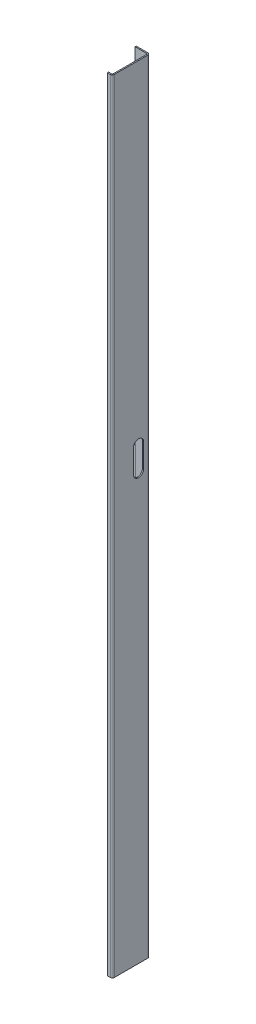
ISO-10303-21;
HEADER;
FILE_DESCRIPTION(('STEP AP214'),'2;1');
FILE_NAME('part.step','',(''),(''),'','','');
FILE_SCHEMA(('AUTOMOTIVE_DESIGN { 1 0 10303 214 1 1 1 1 }'));
ENDSEC;
DATA;
#1=APPLICATION_CONTEXT('core data for automotive mechanical design processes');
#2=APPLICATION_PROTOCOL_DEFINITION('international standard','automotive_design',2000,#1);
#3=PRODUCT_CONTEXT('',#1,'mechanical');
#4=PRODUCT('Part','Part','',(#3));
#5=PRODUCT_RELATED_PRODUCT_CATEGORY('part','',(#4));
#6=PRODUCT_DEFINITION_FORMATION('','',#4);
#7=PRODUCT_DEFINITION_CONTEXT('part definition',#1,'design');
#8=PRODUCT_DEFINITION('design','',#6,#7);
#9=PRODUCT_DEFINITION_SHAPE('','',#8);
#10=(LENGTH_UNIT() NAMED_UNIT(*) SI_UNIT(.MILLI.,.METRE.));
#11=(NAMED_UNIT(*) PLANE_ANGLE_UNIT() SI_UNIT($,.RADIAN.));
#12=(NAMED_UNIT(*) SI_UNIT($,.STERADIAN.) SOLID_ANGLE_UNIT());
#13=UNCERTAINTY_MEASURE_WITH_UNIT(LENGTH_MEASURE(1.E-05),#10,'distance_accuracy_value','');
#14=(GEOMETRIC_REPRESENTATION_CONTEXT(3) GLOBAL_UNCERTAINTY_ASSIGNED_CONTEXT((#13)) GLOBAL_UNIT_ASSIGNED_CONTEXT((#10,
#11,#12)) REPRESENTATION_CONTEXT('',''));
#15=CARTESIAN_POINT('',(0.,0.,0.));
#16=DIRECTION('',(0.,0.,1.));
#17=DIRECTION('',(1.,0.,0.));
#18=AXIS2_PLACEMENT_3D('',#15,#16,#17);
#19=CARTESIAN_POINT('',(-1.5,0.,0.));
#20=DIRECTION('',(-1.,0.,0.));
#21=DIRECTION('',(0.,0.,1.));
#22=AXIS2_PLACEMENT_3D('',#19,#20,#21);
#23=PLANE('',#22);
#24=CARTESIAN_POINT('',(-1.5,544.500000000003,-33.5459415460403));
#25=DIRECTION('',(1.,0.,0.));
#26=DIRECTION('',(0.,0.,-1.));
#27=AXIS2_PLACEMENT_3D('',#24,#25,#26);
#28=CIRCLE('',#27,6.5);
#29=CARTESIAN_POINT('',(-1.5,544.500000000003,-27.0459415460403));
#30=VERTEX_POINT('',#29);
#31=CARTESIAN_POINT('',(-1.5,544.500000000003,-40.0459415460404));
#32=VERTEX_POINT('',#31);
#33=EDGE_CURVE('E198',#30,#32,#28,.T.);
#34=ORIENTED_EDGE('',*,*,#33,.T.);
#35=DIRECTION('',(0.,1.,0.));
#36=VECTOR('',#35,1.);
#37=CARTESIAN_POINT('',(-1.5,544.500000000003,-40.0459415460404));
#38=LINE('',#37,#36);
#39=CARTESIAN_POINT('',(-1.5,574.500000000003,-40.0459415460404));
#40=VERTEX_POINT('',#39);
#41=EDGE_CURVE('E207',#32,#40,#38,.T.);
#42=ORIENTED_EDGE('',*,*,#41,.T.);
#43=CARTESIAN_POINT('',(-1.5,574.500000000003,-33.5459415460403));
#44=DIRECTION('',(1.,0.,0.));
#45=DIRECTION('',(0.,0.,-1.));
#46=AXIS2_PLACEMENT_3D('',#43,#44,#45);
#47=CIRCLE('',#46,6.5);
#48=CARTESIAN_POINT('',(-1.5,574.500000000003,-27.0459415460403));
#49=VERTEX_POINT('',#48);
#50=EDGE_CURVE('E98',#40,#49,#47,.T.);
#51=ORIENTED_EDGE('',*,*,#50,.T.);
#52=DIRECTION('',(0.,-1.,0.));
#53=VECTOR('',#52,1.);
#54=CARTESIAN_POINT('',(-1.5,574.500000000003,-27.0459415460403));
#55=LINE('',#54,#53);
#56=EDGE_CURVE('E204',#49,#30,#55,.T.);
#57=ORIENTED_EDGE('',*,*,#56,.T.);
#58=EDGE_LOOP('',(#34,#42,#51,#57));
#59=FACE_BOUND('',#58,.T.);
#60=DIRECTION('',(0.,0.,-1.));
#61=VECTOR('',#60,1.);
#62=CARTESIAN_POINT('',(-1.5,0.,0.));
#63=LINE('',#62,#61);
#64=CARTESIAN_POINT('',(-1.5,0.,-2.5));
#65=VERTEX_POINT('',#64);
#66=CARTESIAN_POINT('',(-1.5,0.,-45.5));
#67=VERTEX_POINT('',#66);
#68=EDGE_CURVE('E90',#65,#67,#63,.T.);
#69=ORIENTED_EDGE('',*,*,#68,.F.);
#70=DIRECTION('',(0.,1.,0.));
#71=VECTOR('',#70,1.);
#72=CARTESIAN_POINT('',(-1.5,1000.,-2.5));
#73=LINE('',#72,#71);
#74=CARTESIAN_POINT('',(-1.5,1000.,-2.5));
#75=VERTEX_POINT('',#74);
#76=EDGE_CURVE('E274',#75,#65,#73,.F.);
#77=ORIENTED_EDGE('',*,*,#76,.F.);
#78=DIRECTION('',(0.,0.,1.));
#79=VECTOR('',#78,1.);
#80=CARTESIAN_POINT('',(-1.5,1000.,0.));
#81=LINE('',#80,#79);
#82=CARTESIAN_POINT('',(-1.5,1000.,-45.5));
#83=VERTEX_POINT('',#82);
#84=EDGE_CURVE('E13',#83,#75,#81,.T.);
#85=ORIENTED_EDGE('',*,*,#84,.F.);
#86=DIRECTION('',(0.,-1.,0.));
#87=VECTOR('',#86,1.);
#88=CARTESIAN_POINT('',(-1.50000000000001,0.,-45.5));
#89=LINE('',#88,#87);
#90=EDGE_CURVE('E327',#67,#83,#89,.F.);
#91=ORIENTED_EDGE('',*,*,#90,.F.);
#92=EDGE_LOOP('',(#69,#77,#85,#91));
#93=FACE_BOUND('',#92,.T.);
#94=ADVANCED_FACE('F81',(#59,#93),#23,.T.);
#95=CARTESIAN_POINT('',(0.,0.,0.));
#96=DIRECTION('',(-1.,0.,0.));
#97=DIRECTION('',(0.,0.,1.));
#98=AXIS2_PLACEMENT_3D('',#95,#96,#97);
#99=PLANE('',#98);
#100=DIRECTION('',(0.,1.,0.));
#101=VECTOR('',#100,1.);
#102=CARTESIAN_POINT('',(0.,544.500000000003,-40.0459415460404));
#103=LINE('',#102,#101);
#104=CARTESIAN_POINT('',(0.,544.500000000003,-40.0459415460404));
#105=VERTEX_POINT('',#104);
#106=CARTESIAN_POINT('',(0.,574.500000000003,-40.0459415460404));
#107=VERTEX_POINT('',#106);
#108=EDGE_CURVE('E222',#105,#107,#103,.T.);
#109=ORIENTED_EDGE('',*,*,#108,.F.);
#110=CARTESIAN_POINT('',(0.,544.500000000003,-33.5459415460403));
#111=DIRECTION('',(1.,0.,0.));
#112=DIRECTION('',(0.,0.,-1.));
#113=AXIS2_PLACEMENT_3D('',#110,#111,#112);
#114=CIRCLE('',#113,6.5);
#115=CARTESIAN_POINT('',(0.,544.500000000003,-27.0459415460403));
#116=VERTEX_POINT('',#115);
#117=EDGE_CURVE('E106',#116,#105,#114,.T.);
#118=ORIENTED_EDGE('',*,*,#117,.F.);
#119=DIRECTION('',(0.,-1.,0.));
#120=VECTOR('',#119,1.);
#121=CARTESIAN_POINT('',(0.,574.500000000003,-27.0459415460403));
#122=LINE('',#121,#120);
#123=CARTESIAN_POINT('',(0.,574.500000000003,-27.0459415460403));
#124=VERTEX_POINT('',#123);
#125=EDGE_CURVE('E213',#124,#116,#122,.T.);
#126=ORIENTED_EDGE('',*,*,#125,.F.);
#127=CARTESIAN_POINT('',(0.,574.500000000003,-33.5459415460403));
#128=DIRECTION('',(1.,0.,0.));
#129=DIRECTION('',(0.,0.,-1.));
#130=AXIS2_PLACEMENT_3D('',#127,#128,#129);
#131=CIRCLE('',#130,6.5);
#132=EDGE_CURVE('E216',#107,#124,#131,.T.);
#133=ORIENTED_EDGE('',*,*,#132,.F.);
#134=EDGE_LOOP('',(#109,#118,#126,#133));
#135=FACE_BOUND('',#134,.T.);
#136=DIRECTION('',(0.,1.,0.));
#137=VECTOR('',#136,1.);
#138=CARTESIAN_POINT('',(0.,1000.,-2.5));
#139=LINE('',#138,#137);
#140=CARTESIAN_POINT('',(0.,1000.,-2.5));
#141=VERTEX_POINT('',#140);
#142=CARTESIAN_POINT('',(0.,0.,-2.5));
#143=VERTEX_POINT('',#142);
#144=EDGE_CURVE('E262',#141,#143,#139,.F.);
#145=ORIENTED_EDGE('',*,*,#144,.T.);
#146=DIRECTION('',(0.,0.,-1.));
#147=VECTOR('',#146,1.);
#148=CARTESIAN_POINT('',(0.,0.,0.));
#149=LINE('',#148,#147);
#150=CARTESIAN_POINT('',(0.,0.,-45.5));
#151=VERTEX_POINT('',#150);
#152=EDGE_CURVE('E335',#143,#151,#149,.T.);
#153=ORIENTED_EDGE('',*,*,#152,.T.);
#154=DIRECTION('',(0.,-1.,0.));
#155=VECTOR('',#154,1.);
#156=CARTESIAN_POINT('',(0.,0.,-45.5));
#157=LINE('',#156,#155);
#158=CARTESIAN_POINT('',(0.,1000.,-45.5));
#159=VERTEX_POINT('',#158);
#160=EDGE_CURVE('E315',#151,#159,#157,.F.);
#161=ORIENTED_EDGE('',*,*,#160,.T.);
#162=DIRECTION('',(0.,0.,1.));
#163=VECTOR('',#162,1.);
#164=CARTESIAN_POINT('',(0.,1000.,0.));
#165=LINE('',#164,#163);
#166=EDGE_CURVE('E85',#159,#141,#165,.T.);
#167=ORIENTED_EDGE('',*,*,#166,.T.);
#168=EDGE_LOOP('',(#145,#153,#161,#167));
#169=FACE_BOUND('',#168,.T.);
#170=ADVANCED_FACE('F341',(#135,#169),#99,.F.);
#171=CARTESIAN_POINT('',(-1.5,1000.,0.));
#172=DIRECTION('',(0.,1.,0.));
#173=DIRECTION('',(0.,0.,1.));
#174=AXIS2_PLACEMENT_3D('',#171,#172,#173);
#175=PLANE('',#174);
#176=ORIENTED_EDGE('',*,*,#84,.T.);
#177=DIRECTION('',(1.,0.,0.));
#178=VECTOR('',#177,1.);
#179=CARTESIAN_POINT('',(-1.5,1000.,-2.5));
#180=LINE('',#179,#178);
#181=EDGE_CURVE('E268',#75,#141,#180,.T.);
#182=ORIENTED_EDGE('',*,*,#181,.T.);
#183=ORIENTED_EDGE('',*,*,#166,.F.);
#184=DIRECTION('',(1.,0.,0.));
#185=VECTOR('',#184,1.);
#186=CARTESIAN_POINT('',(-1.50000000000001,1000.,-45.5));
#187=LINE('',#186,#185);
#188=EDGE_CURVE('E332',#83,#159,#187,.T.);
#189=ORIENTED_EDGE('',*,*,#188,.F.);
#190=EDGE_LOOP('',(#176,#182,#183,#189));
#191=FACE_BOUND('',#190,.T.);
#192=ADVANCED_FACE('F346',(#191),#175,.T.);
#193=CARTESIAN_POINT('',(-1.5,0.,0.));
#194=DIRECTION('',(0.,-1.,0.));
#195=DIRECTION('',(0.,0.,-1.));
#196=AXIS2_PLACEMENT_3D('',#193,#194,#195);
#197=PLANE('',#196);
#198=DIRECTION('',(1.,0.,0.));
#199=VECTOR('',#198,1.);
#200=CARTESIAN_POINT('',(-1.5,0.,-2.5));
#201=LINE('',#200,#199);
#202=EDGE_CURVE('E279',#65,#143,#201,.T.);
#203=ORIENTED_EDGE('',*,*,#202,.F.);
#204=ORIENTED_EDGE('',*,*,#68,.T.);
#205=DIRECTION('',(1.,0.,0.));
#206=VECTOR('',#205,1.);
#207=CARTESIAN_POINT('',(-1.50000000000001,0.,-45.5));
#208=LINE('',#207,#206);
#209=EDGE_CURVE('E321',#67,#151,#208,.T.);
#210=ORIENTED_EDGE('',*,*,#209,.T.);
#211=ORIENTED_EDGE('',*,*,#152,.F.);
#212=EDGE_LOOP('',(#203,#204,#210,#211));
#213=FACE_BOUND('',#212,.T.);
#214=ADVANCED_FACE('F83',(#213),#197,.T.);
#215=CARTESIAN_POINT('',(-2.50000000000001,1000.,-45.5));
#216=DIRECTION('',(0.,1.,0.));
#217=DIRECTION('',(0.,0.,1.));
#218=AXIS2_PLACEMENT_3D('',#215,#216,#217);
#219=PLANE('',#218);
#220=DIRECTION('',(0.,0.,1.));
#221=VECTOR('',#220,1.);
#222=CARTESIAN_POINT('',(-2.5,1000.,-48.));
#223=LINE('',#222,#221);
#224=CARTESIAN_POINT('',(-2.50000000000001,1000.,-46.5));
#225=VERTEX_POINT('',#224);
#226=CARTESIAN_POINT('',(-2.5,1000.,-48.));
#227=VERTEX_POINT('',#226);
#228=EDGE_CURVE('E282',#225,#227,#223,.F.);
#229=ORIENTED_EDGE('',*,*,#228,.F.);
#230=CARTESIAN_POINT('',(-2.50000000000001,1000.,-45.5));
#231=DIRECTION('',(0.,-1.,0.));
#232=DIRECTION('',(0.,0.,-1.));
#233=AXIS2_PLACEMENT_3D('',#230,#231,#232);
#234=CIRCLE('',#233,1.);
#235=EDGE_CURVE('E324',#83,#225,#234,.F.);
#236=ORIENTED_EDGE('',*,*,#235,.F.);
#237=ORIENTED_EDGE('',*,*,#188,.T.);
#238=CARTESIAN_POINT('',(-2.50000000000001,1000.,-45.5));
#239=DIRECTION('',(0.,-1.,0.));
#240=DIRECTION('',(0.,0.,-1.));
#241=AXIS2_PLACEMENT_3D('',#238,#239,#240);
#242=CIRCLE('',#241,2.5);
#243=EDGE_CURVE('E317',#159,#227,#242,.F.);
#244=ORIENTED_EDGE('',*,*,#243,.T.);
#245=EDGE_LOOP('',(#229,#236,#237,#244));
#246=FACE_BOUND('',#245,.T.);
#247=ADVANCED_FACE('F403',(#246),#219,.T.);
#248=CARTESIAN_POINT('',(-2.50000000000001,0.,-45.5));
#249=DIRECTION('',(0.,1.,0.));
#250=DIRECTION('',(0.,0.,1.));
#251=AXIS2_PLACEMENT_3D('',#248,#249,#250);
#252=PLANE('',#251);
#253=CARTESIAN_POINT('',(-2.50000000000001,0.,-45.5));
#254=DIRECTION('',(0.,-1.,0.));
#255=DIRECTION('',(0.,0.,-1.));
#256=AXIS2_PLACEMENT_3D('',#253,#254,#255);
#257=CIRCLE('',#256,1.);
#258=CARTESIAN_POINT('',(-2.50000000000001,0.,-46.5));
#259=VERTEX_POINT('',#258);
#260=EDGE_CURVE('E288',#259,#67,#257,.T.);
#261=ORIENTED_EDGE('',*,*,#260,.F.);
#262=DIRECTION('',(0.,0.,1.));
#263=VECTOR('',#262,1.);
#264=CARTESIAN_POINT('',(-2.50000000000002,0.,-46.5));
#265=LINE('',#264,#263);
#266=CARTESIAN_POINT('',(-2.50000000000002,0.,-48.));
#267=VERTEX_POINT('',#266);
#268=EDGE_CURVE('E308',#259,#267,#265,.F.);
#269=ORIENTED_EDGE('',*,*,#268,.T.);
#270=CARTESIAN_POINT('',(-2.50000000000001,0.,-45.5));
#271=DIRECTION('',(0.,-1.,0.));
#272=DIRECTION('',(0.,0.,-1.));
#273=AXIS2_PLACEMENT_3D('',#270,#271,#272);
#274=CIRCLE('',#273,2.5);
#275=EDGE_CURVE('E318',#267,#151,#274,.T.);
#276=ORIENTED_EDGE('',*,*,#275,.T.);
#277=ORIENTED_EDGE('',*,*,#209,.F.);
#278=EDGE_LOOP('',(#261,#269,#276,#277));
#279=FACE_BOUND('',#278,.T.);
#280=ADVANCED_FACE('F397',(#279),#252,.F.);
#281=CARTESIAN_POINT('',(-2.50000000000001,0.,-45.5));
#282=DIRECTION('',(0.,-1.,0.));
#283=DIRECTION('',(0.,0.,-1.));
#284=AXIS2_PLACEMENT_3D('',#281,#282,#283);
#285=CYLINDRICAL_SURFACE('',#284,2.5);
#286=ORIENTED_EDGE('',*,*,#160,.F.);
#287=ORIENTED_EDGE('',*,*,#275,.F.);
#288=DIRECTION('',(0.,-1.,0.));
#289=VECTOR('',#288,1.);
#290=CARTESIAN_POINT('',(-2.5,1000.,-48.));
#291=LINE('',#290,#289);
#292=EDGE_CURVE('E306',#267,#227,#291,.F.);
#293=ORIENTED_EDGE('',*,*,#292,.T.);
#294=ORIENTED_EDGE('',*,*,#243,.F.);
#295=EDGE_LOOP('',(#286,#287,#293,#294));
#296=FACE_BOUND('',#295,.T.);
#297=ADVANCED_FACE('F440',(#296),#285,.T.);
#298=CARTESIAN_POINT('',(-2.50000000000001,0.,-45.5));
#299=DIRECTION('',(0.,-1.,0.));
#300=DIRECTION('',(0.,0.,-1.));
#301=AXIS2_PLACEMENT_3D('',#298,#299,#300);
#302=CYLINDRICAL_SURFACE('',#301,1.);
#303=ORIENTED_EDGE('',*,*,#90,.T.);
#304=ORIENTED_EDGE('',*,*,#235,.T.);
#305=DIRECTION('',(0.,-1.,0.));
#306=VECTOR('',#305,1.);
#307=CARTESIAN_POINT('',(-2.5,1000.,-46.5));
#308=LINE('',#307,#306);
#309=EDGE_CURVE('E311',#225,#259,#308,.T.);
#310=ORIENTED_EDGE('',*,*,#309,.T.);
#311=ORIENTED_EDGE('',*,*,#260,.T.);
#312=EDGE_LOOP('',(#303,#304,#310,#311));
#313=FACE_BOUND('',#312,.T.);
#314=ADVANCED_FACE('F417',(#313),#302,.F.);
#315=CARTESIAN_POINT('',(-17.5,0.,-48.0000000000001));
#316=DIRECTION('',(0.,1.,0.));
#317=DIRECTION('',(0.,0.,1.));
#318=AXIS2_PLACEMENT_3D('',#315,#316,#317);
#319=PLANE('',#318);
#320=ORIENTED_EDGE('',*,*,#268,.F.);
#321=DIRECTION('',(1.,0.,0.));
#322=VECTOR('',#321,1.);
#323=CARTESIAN_POINT('',(-17.5,0.,-46.5000000000001));
#324=LINE('',#323,#322);
#325=CARTESIAN_POINT('',(-17.5,0.,-46.5000000000001));
#326=VERTEX_POINT('',#325);
#327=EDGE_CURVE('E304',#259,#326,#324,.F.);
#328=ORIENTED_EDGE('',*,*,#327,.T.);
#329=DIRECTION('',(0.,0.,1.));
#330=VECTOR('',#329,1.);
#331=CARTESIAN_POINT('',(-17.5,0.,-48.0000000000001));
#332=LINE('',#331,#330);
#333=CARTESIAN_POINT('',(-17.5,0.,-48.0000000000001));
#334=VERTEX_POINT('',#333);
#335=EDGE_CURVE('E285',#334,#326,#332,.T.);
#336=ORIENTED_EDGE('',*,*,#335,.F.);
#337=DIRECTION('',(-1.,0.,0.));
#338=VECTOR('',#337,1.);
#339=CARTESIAN_POINT('',(1.71770675702038E-13,0.,-48.));
#340=LINE('',#339,#338);
#341=EDGE_CURVE('E297',#267,#334,#340,.T.);
#342=ORIENTED_EDGE('',*,*,#341,.F.);
#343=EDGE_LOOP('',(#320,#328,#336,#342));
#344=FACE_BOUND('',#343,.T.);
#345=ADVANCED_FACE('F434',(#344),#319,.F.);
#346=CARTESIAN_POINT('',(-1.49999999999999,1000.,-48.));
#347=DIRECTION('',(0.,-1.,0.));
#348=DIRECTION('',(0.,0.,-1.));
#349=AXIS2_PLACEMENT_3D('',#346,#347,#348);
#350=PLANE('',#349);
#351=ORIENTED_EDGE('',*,*,#228,.T.);
#352=DIRECTION('',(1.,0.,0.));
#353=VECTOR('',#352,1.);
#354=CARTESIAN_POINT('',(1.71770675702038E-13,1000.,-48.));
#355=LINE('',#354,#353);
#356=CARTESIAN_POINT('',(-17.5,1000.,-48.0000000000001));
#357=VERTEX_POINT('',#356);
#358=EDGE_CURVE('E292',#357,#227,#355,.T.);
#359=ORIENTED_EDGE('',*,*,#358,.F.);
#360=DIRECTION('',(0.,0.,1.));
#361=VECTOR('',#360,1.);
#362=CARTESIAN_POINT('',(-17.5,1000.,-48.0000000000001));
#363=LINE('',#362,#361);
#364=CARTESIAN_POINT('',(-17.5,1000.,-46.5000000000001));
#365=VERTEX_POINT('',#364);
#366=EDGE_CURVE('E289',#357,#365,#363,.T.);
#367=ORIENTED_EDGE('',*,*,#366,.T.);
#368=DIRECTION('',(-1.,0.,0.));
#369=VECTOR('',#368,1.);
#370=CARTESIAN_POINT('',(-1.5,1000.,-46.5));
#371=LINE('',#370,#369);
#372=EDGE_CURVE('E299',#365,#225,#371,.F.);
#373=ORIENTED_EDGE('',*,*,#372,.T.);
#374=EDGE_LOOP('',(#351,#359,#367,#373));
#375=FACE_BOUND('',#374,.T.);
#376=ADVANCED_FACE('F425',(#375),#350,.F.);
#377=CARTESIAN_POINT('',(1.71770675702038E-13,0.,-48.));
#378=DIRECTION('',(0.,0.,1.));
#379=DIRECTION('',(1.,0.,0.));
#380=AXIS2_PLACEMENT_3D('',#377,#378,#379);
#381=PLANE('',#380);
#382=ORIENTED_EDGE('',*,*,#292,.F.);
#383=ORIENTED_EDGE('',*,*,#341,.T.);
#384=DIRECTION('',(0.,1.,0.));
#385=VECTOR('',#384,1.);
#386=CARTESIAN_POINT('',(-17.5,0.,-48.0000000000001));
#387=LINE('',#386,#385);
#388=EDGE_CURVE('E295',#334,#357,#387,.T.);
#389=ORIENTED_EDGE('',*,*,#388,.T.);
#390=ORIENTED_EDGE('',*,*,#358,.T.);
#391=EDGE_LOOP('',(#382,#383,#389,#390));
#392=FACE_BOUND('',#391,.T.);
#393=ADVANCED_FACE('F437',(#392),#381,.F.);
#394=CARTESIAN_POINT('',(1.66533453693773E-13,0.,-46.5));
#395=DIRECTION('',(0.,0.,1.));
#396=DIRECTION('',(1.,0.,0.));
#397=AXIS2_PLACEMENT_3D('',#394,#395,#396);
#398=PLANE('',#397);
#399=ORIENTED_EDGE('',*,*,#327,.F.);
#400=ORIENTED_EDGE('',*,*,#309,.F.);
#401=ORIENTED_EDGE('',*,*,#372,.F.);
#402=DIRECTION('',(0.,-1.,0.));
#403=VECTOR('',#402,1.);
#404=CARTESIAN_POINT('',(-17.5,1000.,-46.5000000000001));
#405=LINE('',#404,#403);
#406=EDGE_CURVE('E302',#326,#365,#405,.F.);
#407=ORIENTED_EDGE('',*,*,#406,.F.);
#408=EDGE_LOOP('',(#399,#400,#401,#407));
#409=FACE_BOUND('',#408,.T.);
#410=ADVANCED_FACE('F422',(#409),#398,.T.);
#411=CARTESIAN_POINT('',(-17.5,1000.,-48.0000000000001));
#412=DIRECTION('',(1.,0.,0.));
#413=DIRECTION('',(0.,0.,-1.));
#414=AXIS2_PLACEMENT_3D('',#411,#412,#413);
#415=PLANE('',#414);
#416=ORIENTED_EDGE('',*,*,#406,.T.);
#417=ORIENTED_EDGE('',*,*,#366,.F.);
#418=ORIENTED_EDGE('',*,*,#388,.F.);
#419=ORIENTED_EDGE('',*,*,#335,.T.);
#420=EDGE_LOOP('',(#416,#417,#418,#419));
#421=FACE_BOUND('',#420,.T.);
#422=ADVANCED_FACE('F430',(#421),#415,.F.);
#423=CARTESIAN_POINT('',(-2.5,0.,-2.5));
#424=DIRECTION('',(0.,-1.,0.));
#425=DIRECTION('',(0.,0.,-1.));
#426=AXIS2_PLACEMENT_3D('',#423,#424,#425);
#427=PLANE('',#426);
#428=DIRECTION('',(0.,0.,-1.));
#429=VECTOR('',#428,1.);
#430=CARTESIAN_POINT('',(-2.5,0.,0.));
#431=LINE('',#430,#429);
#432=CARTESIAN_POINT('',(-2.49999999999999,0.,-1.5));
#433=VERTEX_POINT('',#432);
#434=CARTESIAN_POINT('',(-2.49999999999999,0.,0.));
#435=VERTEX_POINT('',#434);
#436=EDGE_CURVE('E228',#433,#435,#431,.F.);
#437=ORIENTED_EDGE('',*,*,#436,.F.);
#438=CARTESIAN_POINT('',(-2.5,0.,-2.5));
#439=DIRECTION('',(0.,1.,0.));
#440=DIRECTION('',(0.,0.,1.));
#441=AXIS2_PLACEMENT_3D('',#438,#439,#440);
#442=CIRCLE('',#441,1.);
#443=EDGE_CURVE('E271',#65,#433,#442,.F.);
#444=ORIENTED_EDGE('',*,*,#443,.F.);
#445=ORIENTED_EDGE('',*,*,#202,.T.);
#446=CARTESIAN_POINT('',(-2.5,0.,-2.5));
#447=DIRECTION('',(0.,1.,0.));
#448=DIRECTION('',(0.,0.,1.));
#449=AXIS2_PLACEMENT_3D('',#446,#447,#448);
#450=CIRCLE('',#449,2.5);
#451=EDGE_CURVE('E264',#143,#435,#450,.F.);
#452=ORIENTED_EDGE('',*,*,#451,.T.);
#453=EDGE_LOOP('',(#437,#444,#445,#452));
#454=FACE_BOUND('',#453,.T.);
#455=ADVANCED_FACE('F374',(#454),#427,.T.);
#456=CARTESIAN_POINT('',(-2.5,1000.,-2.5));
#457=DIRECTION('',(0.,-1.,0.));
#458=DIRECTION('',(0.,0.,-1.));
#459=AXIS2_PLACEMENT_3D('',#456,#457,#458);
#460=PLANE('',#459);
#461=CARTESIAN_POINT('',(-2.5,1000.,-2.5));
#462=DIRECTION('',(0.,1.,0.));
#463=DIRECTION('',(0.,0.,1.));
#464=AXIS2_PLACEMENT_3D('',#461,#462,#463);
#465=CIRCLE('',#464,1.);
#466=CARTESIAN_POINT('',(-2.49999999999999,1000.,-1.5));
#467=VERTEX_POINT('',#466);
#468=EDGE_CURVE('E235',#467,#75,#465,.T.);
#469=ORIENTED_EDGE('',*,*,#468,.F.);
#470=DIRECTION('',(0.,0.,-1.));
#471=VECTOR('',#470,1.);
#472=CARTESIAN_POINT('',(-2.5,1000.,-1.5));
#473=LINE('',#472,#471);
#474=CARTESIAN_POINT('',(-2.5,1000.,0.));
#475=VERTEX_POINT('',#474);
#476=EDGE_CURVE('E255',#467,#475,#473,.F.);
#477=ORIENTED_EDGE('',*,*,#476,.T.);
#478=CARTESIAN_POINT('',(-2.5,1000.,-2.5));
#479=DIRECTION('',(0.,1.,0.));
#480=DIRECTION('',(0.,0.,1.));
#481=AXIS2_PLACEMENT_3D('',#478,#479,#480);
#482=CIRCLE('',#481,2.5);
#483=EDGE_CURVE('E265',#475,#141,#482,.T.);
#484=ORIENTED_EDGE('',*,*,#483,.T.);
#485=ORIENTED_EDGE('',*,*,#181,.F.);
#486=EDGE_LOOP('',(#469,#477,#484,#485));
#487=FACE_BOUND('',#486,.T.);
#488=ADVANCED_FACE('F353',(#487),#460,.F.);
#489=CARTESIAN_POINT('',(-2.5,1000.,-2.5));
#490=DIRECTION('',(0.,1.,0.));
#491=DIRECTION('',(0.,0.,1.));
#492=AXIS2_PLACEMENT_3D('',#489,#490,#491);
#493=CYLINDRICAL_SURFACE('',#492,2.5);
#494=ORIENTED_EDGE('',*,*,#144,.F.);
#495=ORIENTED_EDGE('',*,*,#483,.F.);
#496=DIRECTION('',(0.,1.,0.));
#497=VECTOR('',#496,1.);
#498=CARTESIAN_POINT('',(-2.5,0.,0.));
#499=LINE('',#498,#497);
#500=EDGE_CURVE('E253',#475,#435,#499,.F.);
#501=ORIENTED_EDGE('',*,*,#500,.T.);
#502=ORIENTED_EDGE('',*,*,#451,.F.);
#503=EDGE_LOOP('',(#494,#495,#501,#502));
#504=FACE_BOUND('',#503,.T.);
#505=ADVANCED_FACE('F352',(#504),#493,.T.);
#506=CARTESIAN_POINT('',(-2.5,1000.,-2.5));
#507=DIRECTION('',(0.,1.,0.));
#508=DIRECTION('',(0.,0.,1.));
#509=AXIS2_PLACEMENT_3D('',#506,#507,#508);
#510=CYLINDRICAL_SURFACE('',#509,1.);
#511=ORIENTED_EDGE('',*,*,#76,.T.);
#512=ORIENTED_EDGE('',*,*,#443,.T.);
#513=DIRECTION('',(0.,1.,0.));
#514=VECTOR('',#513,1.);
#515=CARTESIAN_POINT('',(-2.5,0.,-1.5));
#516=LINE('',#515,#514);
#517=EDGE_CURVE('E258',#433,#467,#516,.T.);
#518=ORIENTED_EDGE('',*,*,#517,.T.);
#519=ORIENTED_EDGE('',*,*,#468,.T.);
#520=EDGE_LOOP('',(#511,#512,#518,#519));
#521=FACE_BOUND('',#520,.T.);
#522=ADVANCED_FACE('F377',(#521),#510,.F.);
#523=CARTESIAN_POINT('',(-6.5,1000.,0.));
#524=DIRECTION('',(0.,-1.,0.));
#525=DIRECTION('',(0.,0.,-1.));
#526=AXIS2_PLACEMENT_3D('',#523,#524,#525);
#527=PLANE('',#526);
#528=ORIENTED_EDGE('',*,*,#476,.F.);
#529=DIRECTION('',(1.,0.,0.));
#530=VECTOR('',#529,1.);
#531=CARTESIAN_POINT('',(-6.5,1000.,-1.49999999999998));
#532=LINE('',#531,#530);
#533=CARTESIAN_POINT('',(-6.5,1000.,-1.49999999999998));
#534=VERTEX_POINT('',#533);
#535=EDGE_CURVE('E251',#467,#534,#532,.F.);
#536=ORIENTED_EDGE('',*,*,#535,.T.);
#537=DIRECTION('',(0.,0.,-1.));
#538=VECTOR('',#537,1.);
#539=CARTESIAN_POINT('',(-6.5,1000.,0.));
#540=LINE('',#539,#538);
#541=CARTESIAN_POINT('',(-6.5,1000.,0.));
#542=VERTEX_POINT('',#541);
#543=EDGE_CURVE('E232',#542,#534,#540,.T.);
#544=ORIENTED_EDGE('',*,*,#543,.F.);
#545=DIRECTION('',(-1.,0.,0.));
#546=VECTOR('',#545,1.);
#547=CARTESIAN_POINT('',(0.,1000.,0.));
#548=LINE('',#547,#546);
#549=EDGE_CURVE('E244',#475,#542,#548,.T.);
#550=ORIENTED_EDGE('',*,*,#549,.F.);
#551=EDGE_LOOP('',(#528,#536,#544,#550));
#552=FACE_BOUND('',#551,.T.);
#553=ADVANCED_FACE('F363',(#552),#527,.F.);
#554=CARTESIAN_POINT('',(-1.49999999999999,0.,0.));
#555=DIRECTION('',(0.,1.,0.));
#556=DIRECTION('',(0.,0.,1.));
#557=AXIS2_PLACEMENT_3D('',#554,#555,#556);
#558=PLANE('',#557);
#559=ORIENTED_EDGE('',*,*,#436,.T.);
#560=DIRECTION('',(1.,0.,0.));
#561=VECTOR('',#560,1.);
#562=CARTESIAN_POINT('',(0.,0.,0.));
#563=LINE('',#562,#561);
#564=CARTESIAN_POINT('',(-6.5,0.,0.));
#565=VERTEX_POINT('',#564);
#566=EDGE_CURVE('E239',#565,#435,#563,.T.);
#567=ORIENTED_EDGE('',*,*,#566,.F.);
#568=DIRECTION('',(0.,0.,-1.));
#569=VECTOR('',#568,1.);
#570=CARTESIAN_POINT('',(-6.5,0.,0.));
#571=LINE('',#570,#569);
#572=CARTESIAN_POINT('',(-6.5,0.,-1.49999999999998));
#573=VERTEX_POINT('',#572);
#574=EDGE_CURVE('E236',#565,#573,#571,.T.);
#575=ORIENTED_EDGE('',*,*,#574,.T.);
#576=DIRECTION('',(-1.,0.,0.));
#577=VECTOR('',#576,1.);
#578=CARTESIAN_POINT('',(-1.5,0.,-1.5));
#579=LINE('',#578,#577);
#580=EDGE_CURVE('E246',#573,#433,#579,.F.);
#581=ORIENTED_EDGE('',*,*,#580,.T.);
#582=EDGE_LOOP('',(#559,#567,#575,#581));
#583=FACE_BOUND('',#582,.T.);
#584=ADVANCED_FACE('F371',(#583),#558,.F.);
#585=CARTESIAN_POINT('',(0.,0.,0.));
#586=DIRECTION('',(0.,0.,-1.));
#587=DIRECTION('',(-1.,0.,0.));
#588=AXIS2_PLACEMENT_3D('',#585,#586,#587);
#589=PLANE('',#588);
#590=ORIENTED_EDGE('',*,*,#500,.F.);
#591=ORIENTED_EDGE('',*,*,#549,.T.);
#592=DIRECTION('',(0.,-1.,0.));
#593=VECTOR('',#592,1.);
#594=CARTESIAN_POINT('',(-6.5,0.,0.));
#595=LINE('',#594,#593);
#596=EDGE_CURVE('E242',#542,#565,#595,.T.);
#597=ORIENTED_EDGE('',*,*,#596,.T.);
#598=ORIENTED_EDGE('',*,*,#566,.T.);
#599=EDGE_LOOP('',(#590,#591,#597,#598));
#600=FACE_BOUND('',#599,.T.);
#601=ADVANCED_FACE('F360',(#600),#589,.F.);
#602=CARTESIAN_POINT('',(0.,0.,-1.50000000000001));
#603=DIRECTION('',(0.,0.,-1.));
#604=DIRECTION('',(-1.,0.,0.));
#605=AXIS2_PLACEMENT_3D('',#602,#603,#604);
#606=PLANE('',#605);
#607=ORIENTED_EDGE('',*,*,#535,.F.);
#608=ORIENTED_EDGE('',*,*,#517,.F.);
#609=ORIENTED_EDGE('',*,*,#580,.F.);
#610=DIRECTION('',(0.,1.,0.));
#611=VECTOR('',#610,1.);
#612=CARTESIAN_POINT('',(-6.5,0.,-1.49999999999998));
#613=LINE('',#612,#611);
#614=EDGE_CURVE('E249',#534,#573,#613,.F.);
#615=ORIENTED_EDGE('',*,*,#614,.F.);
#616=EDGE_LOOP('',(#607,#608,#609,#615));
#617=FACE_BOUND('',#616,.T.);
#618=ADVANCED_FACE('F379',(#617),#606,.T.);
#619=CARTESIAN_POINT('',(-6.5,0.,0.));
#620=DIRECTION('',(1.,0.,0.));
#621=DIRECTION('',(0.,0.,-1.));
#622=AXIS2_PLACEMENT_3D('',#619,#620,#621);
#623=PLANE('',#622);
#624=ORIENTED_EDGE('',*,*,#614,.T.);
#625=ORIENTED_EDGE('',*,*,#574,.F.);
#626=ORIENTED_EDGE('',*,*,#596,.F.);
#627=ORIENTED_EDGE('',*,*,#543,.T.);
#628=EDGE_LOOP('',(#624,#625,#626,#627));
#629=FACE_BOUND('',#628,.T.);
#630=ADVANCED_FACE('F368',(#629),#623,.F.);
#631=CARTESIAN_POINT('',(-1.5,544.500000000003,-33.5459415460403));
#632=DIRECTION('',(1.,0.,0.));
#633=DIRECTION('',(0.,0.,-1.));
#634=AXIS2_PLACEMENT_3D('',#631,#632,#633);
#635=CYLINDRICAL_SURFACE('',#634,6.5);
#636=ORIENTED_EDGE('',*,*,#117,.T.);
#637=DIRECTION('',(1.,0.,0.));
#638=VECTOR('',#637,1.);
#639=CARTESIAN_POINT('',(-1.5,544.500000000003,-40.0459415460404));
#640=LINE('',#639,#638);
#641=EDGE_CURVE('E194',#32,#105,#640,.T.);
#642=ORIENTED_EDGE('',*,*,#641,.F.);
#643=ORIENTED_EDGE('',*,*,#33,.F.);
#644=DIRECTION('',(1.,0.,0.));
#645=VECTOR('',#644,1.);
#646=CARTESIAN_POINT('',(-1.5,544.500000000003,-27.0459415460403));
#647=LINE('',#646,#645);
#648=EDGE_CURVE('E226',#30,#116,#647,.T.);
#649=ORIENTED_EDGE('',*,*,#648,.T.);
#650=EDGE_LOOP('',(#636,#642,#643,#649));
#651=FACE_BOUND('',#650,.T.);
#652=ADVANCED_FACE('F196',(#651),#635,.F.);
#653=CARTESIAN_POINT('',(-1.5,574.500000000003,-27.0459415460403));
#654=DIRECTION('',(0.,0.,1.));
#655=DIRECTION('',(1.,0.,0.));
#656=AXIS2_PLACEMENT_3D('',#653,#654,#655);
#657=PLANE('',#656);
#658=ORIENTED_EDGE('',*,*,#125,.T.);
#659=ORIENTED_EDGE('',*,*,#648,.F.);
#660=ORIENTED_EDGE('',*,*,#56,.F.);
#661=DIRECTION('',(1.,0.,0.));
#662=VECTOR('',#661,1.);
#663=CARTESIAN_POINT('',(-1.5,574.500000000003,-27.0459415460403));
#664=LINE('',#663,#662);
#665=EDGE_CURVE('E229',#49,#124,#664,.T.);
#666=ORIENTED_EDGE('',*,*,#665,.T.);
#667=EDGE_LOOP('',(#658,#659,#660,#666));
#668=FACE_BOUND('',#667,.T.);
#669=ADVANCED_FACE('F513',(#668),#657,.F.);
#670=CARTESIAN_POINT('',(-1.5,574.500000000003,-33.5459415460403));
#671=DIRECTION('',(1.,0.,0.));
#672=DIRECTION('',(0.,0.,-1.));
#673=AXIS2_PLACEMENT_3D('',#670,#671,#672);
#674=CYLINDRICAL_SURFACE('',#673,6.5);
#675=ORIENTED_EDGE('',*,*,#132,.T.);
#676=ORIENTED_EDGE('',*,*,#665,.F.);
#677=ORIENTED_EDGE('',*,*,#50,.F.);
#678=DIRECTION('',(1.,0.,0.));
#679=VECTOR('',#678,1.);
#680=CARTESIAN_POINT('',(-1.5,574.500000000003,-40.0459415460404));
#681=LINE('',#680,#679);
#682=EDGE_CURVE('E203',#40,#107,#681,.T.);
#683=ORIENTED_EDGE('',*,*,#682,.T.);
#684=EDGE_LOOP('',(#675,#676,#677,#683));
#685=FACE_BOUND('',#684,.T.);
#686=ADVANCED_FACE('F522',(#685),#674,.F.);
#687=CARTESIAN_POINT('',(-1.5,544.500000000003,-40.0459415460404));
#688=DIRECTION('',(0.,0.,-1.));
#689=DIRECTION('',(-1.,0.,0.));
#690=AXIS2_PLACEMENT_3D('',#687,#688,#689);
#691=PLANE('',#690);
#692=ORIENTED_EDGE('',*,*,#108,.T.);
#693=ORIENTED_EDGE('',*,*,#682,.F.);
#694=ORIENTED_EDGE('',*,*,#41,.F.);
#695=ORIENTED_EDGE('',*,*,#641,.T.);
#696=EDGE_LOOP('',(#692,#693,#694,#695));
#697=FACE_BOUND('',#696,.T.);
#698=ADVANCED_FACE('F208',(#697),#691,.F.);
#699=CLOSED_SHELL('',(#94,#170,#192,#214,#247,#280,#297,#314,#345,#376,#393,#410,#422,#455,#488,
#505,#522,#553,#584,#601,#618,#630,#652,#669,#686,#698));
#700=MANIFOLD_SOLID_BREP('B2',#699);
#701=ADVANCED_BREP_SHAPE_REPRESENTATION('',(#18,#700),#14);
#702=SHAPE_DEFINITION_REPRESENTATION(#9,#701);
ENDSEC;
END-ISO-10303-21;
